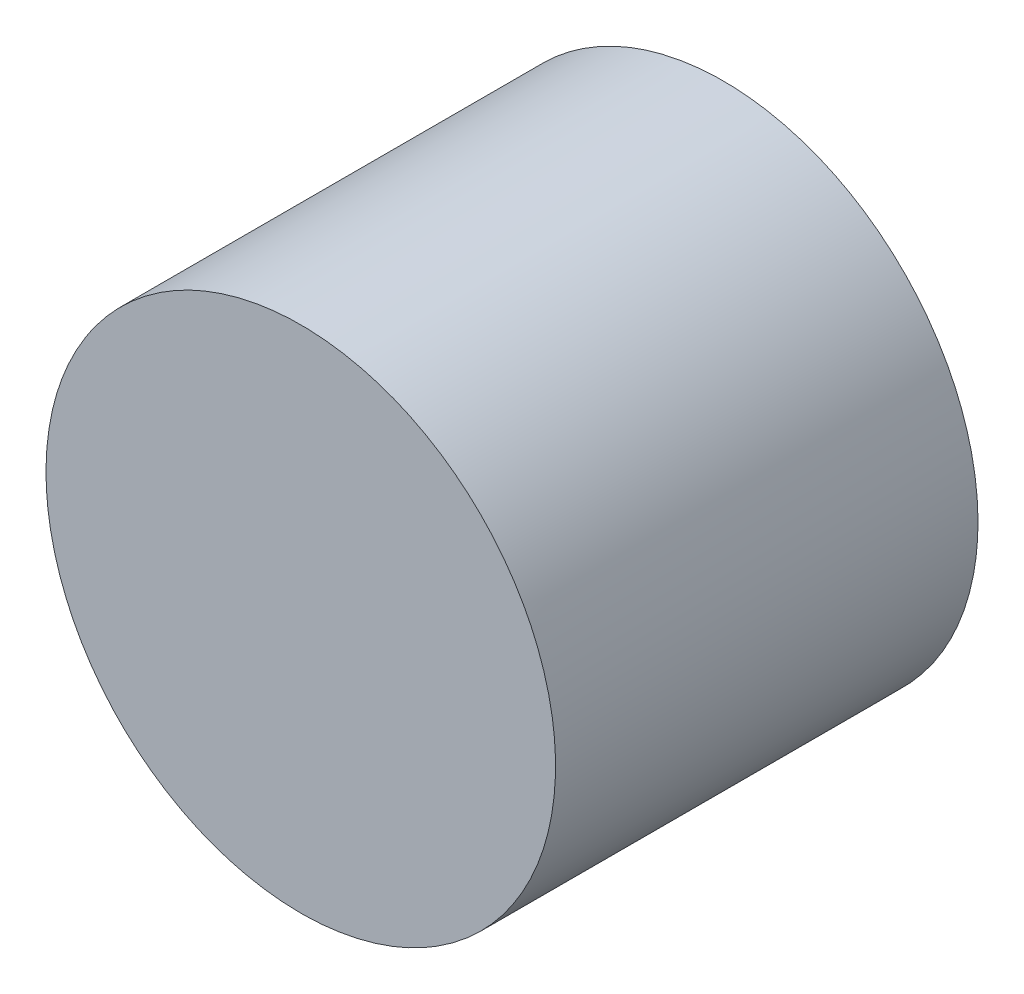
ISO-10303-21;
HEADER;
FILE_DESCRIPTION(('STEP AP214'),'2;1');
FILE_NAME('part.step','',(''),(''),'','','');
FILE_SCHEMA(('AUTOMOTIVE_DESIGN { 1 0 10303 214 1 1 1 1 }'));
ENDSEC;
DATA;
#1=APPLICATION_CONTEXT('core data for automotive mechanical design processes');
#2=APPLICATION_PROTOCOL_DEFINITION('international standard','automotive_design',2000,#1);
#3=PRODUCT_CONTEXT('',#1,'mechanical');
#4=PRODUCT('Part','Part','',(#3));
#5=PRODUCT_RELATED_PRODUCT_CATEGORY('part','',(#4));
#6=PRODUCT_DEFINITION_FORMATION('','',#4);
#7=PRODUCT_DEFINITION_CONTEXT('part definition',#1,'design');
#8=PRODUCT_DEFINITION('design','',#6,#7);
#9=PRODUCT_DEFINITION_SHAPE('','',#8);
#10=(LENGTH_UNIT() NAMED_UNIT(*) SI_UNIT(.MILLI.,.METRE.));
#11=(NAMED_UNIT(*) PLANE_ANGLE_UNIT() SI_UNIT($,.RADIAN.));
#12=(NAMED_UNIT(*) SI_UNIT($,.STERADIAN.) SOLID_ANGLE_UNIT());
#13=UNCERTAINTY_MEASURE_WITH_UNIT(LENGTH_MEASURE(1.E-05),#10,'distance_accuracy_value','');
#14=(GEOMETRIC_REPRESENTATION_CONTEXT(3) GLOBAL_UNCERTAINTY_ASSIGNED_CONTEXT((#13)) GLOBAL_UNIT_ASSIGNED_CONTEXT((#10,
#11,#12)) REPRESENTATION_CONTEXT('',''));
#15=CARTESIAN_POINT('',(0.,0.,0.));
#16=DIRECTION('',(0.,0.,1.));
#17=DIRECTION('',(1.,0.,0.));
#18=AXIS2_PLACEMENT_3D('',#15,#16,#17);
#19=CARTESIAN_POINT('',(1.08717444967118,89.1708663738326,123.808385168912));
#20=CARTESIAN_POINT('',(1.15446644135423,89.1708663738326,123.808385168912));
#21=CARTESIAN_POINT('',(1.28905042472035,89.1976367925753,123.808385168912));
#22=CARTESIAN_POINT('',(1.46019261257854,89.3119903465489,123.808385168912));
#23=CARTESIAN_POINT('',(1.57454616655218,89.4831325344072,123.808385168912));
#24=CARTESIAN_POINT('',(1.61470179466628,89.6850085094563,123.808385168912));
#25=CARTESIAN_POINT('',(1.57454616655218,89.8868844845055,123.808385168912));
#26=CARTESIAN_POINT('',(1.46019261257854,90.0580266723637,123.808385168912));
#27=CARTESIAN_POINT('',(1.28905042472035,90.1723802263373,123.808385168912));
#28=CARTESIAN_POINT('',(1.08717444967118,90.2125358544514,123.808385168912));
#29=CARTESIAN_POINT('',(0.885298474622008,90.1723802263373,123.808385168912));
#30=CARTESIAN_POINT('',(0.714156286763815,90.0580266723636,123.808385168912));
#31=CARTESIAN_POINT('',(0.599802732790181,89.8868844845055,123.808385168912));
#32=CARTESIAN_POINT('',(0.559647104676082,89.6850085094563,123.808385168912));
#33=CARTESIAN_POINT('',(0.599802732790181,89.4831325344071,123.808385168912));
#34=CARTESIAN_POINT('',(0.714156286763815,89.3119903465489,123.808385168912));
#35=CARTESIAN_POINT('',(0.885298474622008,89.1976367925753,123.808385168912));
#36=CARTESIAN_POINT('',(1.01988245798812,89.1708663738326,123.808385168912));
#37=CARTESIAN_POINT('',(1.08717444967118,89.1708663738326,123.808385168912));
#38=B_SPLINE_CURVE_WITH_KNOTS('',3,(#19,#20,#21,#22,#23,#24,#25,#26,#27,#28,#29,#30,#31,#32,#33,
#34,#35,#36,#37),.UNSPECIFIED.,.T.,.F.,(4,1,1,1,1,1,1,1,1,1,1,1,1,1,1,1,4),(0.,
0.0625000000000003,0.125000000000001,0.187499999999999,0.25,0.312500000000002,0.374999999999999,
0.4375,0.5,0.562500000000001,0.625000000000001,0.687499999999999,0.75,0.812500000000001,
0.874999999999999,0.9375,1.),.UNSPECIFIED.);
#39=DIRECTION('',(0.,0.,1.));
#40=VECTOR('',#39,1.);
#41=SURFACE_OF_LINEAR_EXTRUSION('',#38,#40);
#42=CARTESIAN_POINT('',(1.08717444967118,89.1708663738326,123.808385168912));
#43=CARTESIAN_POINT('',(1.15446644135423,89.1708663738326,123.808385168912));
#44=CARTESIAN_POINT('',(1.28905042472035,89.1976367925753,123.808385168912));
#45=CARTESIAN_POINT('',(1.46019261257854,89.3119903465489,123.808385168912));
#46=CARTESIAN_POINT('',(1.57454616655218,89.4831325344072,123.808385168912));
#47=CARTESIAN_POINT('',(1.61470179466628,89.6850085094563,123.808385168912));
#48=CARTESIAN_POINT('',(1.57454616655218,89.8868844845055,123.808385168912));
#49=CARTESIAN_POINT('',(1.46019261257854,90.0580266723637,123.808385168912));
#50=CARTESIAN_POINT('',(1.28905042472035,90.1723802263373,123.808385168912));
#51=CARTESIAN_POINT('',(1.08717444967118,90.2125358544514,123.808385168912));
#52=CARTESIAN_POINT('',(0.885298474622008,90.1723802263373,123.808385168912));
#53=CARTESIAN_POINT('',(0.714156286763815,90.0580266723636,123.808385168912));
#54=CARTESIAN_POINT('',(0.599802732790181,89.8868844845055,123.808385168912));
#55=CARTESIAN_POINT('',(0.559647104676082,89.6850085094563,123.808385168912));
#56=CARTESIAN_POINT('',(0.599802732790181,89.4831325344071,123.808385168912));
#57=CARTESIAN_POINT('',(0.714156286763815,89.3119903465489,123.808385168912));
#58=CARTESIAN_POINT('',(0.885298474622008,89.1976367925753,123.808385168912));
#59=CARTESIAN_POINT('',(1.01988245798812,89.1708663738326,123.808385168912));
#60=CARTESIAN_POINT('',(1.08717444967118,89.1708663738326,123.808385168912));
#61=B_SPLINE_CURVE_WITH_KNOTS('',3,(#42,#43,#44,#45,#46,#47,#48,#49,#50,#51,#52,#53,#54,#55,#56,
#57,#58,#59,#60),.UNSPECIFIED.,.T.,.F.,(4,1,1,1,1,1,1,1,1,1,1,1,1,1,1,1,4),(0.,
0.0625000000000003,0.125000000000001,0.187499999999999,0.25,0.312500000000002,0.374999999999999,
0.4375,0.5,0.562500000000001,0.625000000000001,0.687499999999999,0.75,0.812500000000001,
0.874999999999999,0.9375,1.),.UNSPECIFIED.);
#62=CARTESIAN_POINT('',(1.08717444967118,89.1708663738326,123.808385168912));
#63=VERTEX_POINT('',#62);
#64=EDGE_CURVE('E9',#63,#63,#61,.T.);
#65=ORIENTED_EDGE('',*,*,#64,.T.);
#66=EDGE_LOOP('',(#65));
#67=FACE_BOUND('',#66,.T.);
#68=CARTESIAN_POINT('',(1.08717444967118,89.1708663738326,124.660837467507));
#69=CARTESIAN_POINT('',(1.07876275223544,89.1708663677429,124.660837467507));
#70=CARTESIAN_POINT('',(1.07035122939483,89.1710755268702,124.660837467507));
#71=CARTESIAN_POINT('',(1.0535481908906,89.1719081286321,124.660837467507));
#72=CARTESIAN_POINT('',(1.04515667643318,89.1725315956393,124.660837467507));
#73=CARTESIAN_POINT('',(1.02841373267933,89.1741888221434,124.660837467507));
#74=CARTESIAN_POINT('',(1.02006230617347,89.1752226097958,124.660837467507));
#75=CARTESIAN_POINT('',(1.00341949531202,89.1776965007436,124.660837467507));
#76=CARTESIAN_POINT('',(0.995128113561799,89.1791366215629,124.660837467507));
#77=CARTESIAN_POINT('',(0.97862538519768,89.1824192180605,124.660837467507));
#78=CARTESIAN_POINT('',(0.970414038583785,89.1842616937387,124.660837467507));
#79=CARTESIAN_POINT('',(0.954091365970359,89.1883450462289,124.660837467507));
#80=CARTESIAN_POINT('',(0.945980035672058,89.1905859058539,124.660837467507));
#81=CARTESIAN_POINT('',(0.929877392462701,89.195462069037,124.660837467507));
#82=CARTESIAN_POINT('',(0.921886071353629,89.1980973455158,124.660837467507));
#83=CARTESIAN_POINT('',(0.906043416453419,89.2037583899285,124.660837467507));
#84=CARTESIAN_POINT('',(0.898192074454572,89.2067841348809,124.660837467507));
#85=CARTESIAN_POINT('',(0.88264947051977,89.2132220922228,124.660837467507));
#86=CARTESIAN_POINT('',(0.874958208583815,89.2166343046122,124.660837467507));
#87=CARTESIAN_POINT('',(0.859752796967187,89.2238337904464,124.660837467507));
#88=CARTESIAN_POINT('',(0.852238657733153,89.2276210859452,124.660837467507));
#89=CARTESIAN_POINT('',(0.83740440152103,89.2355594060446,124.660837467507));
#90=CARTESIAN_POINT('',(0.830084297894062,89.2397104555901,124.660837467507));
#91=CARTESIAN_POINT('',(0.815655058981271,89.2483649620552,124.660837467507));
#92=CARTESIAN_POINT('',(0.808545932808855,89.2528684341677,124.660837467507));
#93=CARTESIAN_POINT('',(0.794555596121782,89.2622164782792,124.660837467507));
#94=CARTESIAN_POINT('',(0.787674385607126,89.2670610502784,124.660837467507));
#95=CARTESIAN_POINT('',(0.774156833546462,89.2770799925402,124.660837467507));
#96=CARTESIAN_POINT('',(0.767520481451673,89.2822543485692,124.660837467507));
#97=CARTESIAN_POINT('',(0.754509605905568,89.2929215506804,124.660837467507));
#98=CARTESIAN_POINT('',(0.748135064517465,89.2984143748818,124.660837467507));
#99=CARTESIAN_POINT('',(0.735664747802227,89.3097072195089,124.660837467507));
#100=CARTESIAN_POINT('',(0.72956895609752,89.3155072218434,124.660837467507));
#101=CARTESIAN_POINT('',(0.717673162058296,89.3274030158826,124.660837467507));
#102=CARTESIAN_POINT('',(0.711873159723778,89.3334988075873,124.660837467507));
#103=CARTESIAN_POINT('',(0.700580315096693,89.3459691243026,124.660837467507));
#104=CARTESIAN_POINT('',(0.695087490895299,89.3523436656907,124.660837467507));
#105=CARTESIAN_POINT('',(0.684420288784116,89.3653545412368,124.660837467507));
#106=CARTESIAN_POINT('',(0.679245932755136,89.3719908933316,124.660837467507));
#107=CARTESIAN_POINT('',(0.669226990493276,89.3855084453922,124.660837467507));
#108=CARTESIAN_POINT('',(0.664382418494125,89.3923896559069,124.660837467507));
#109=CARTESIAN_POINT('',(0.655034374382544,89.406379992594,124.660837467507));
#110=CARTESIAN_POINT('',(0.650530902270114,89.4134891187663,124.660837467507));
#111=CARTESIAN_POINT('',(0.641876395805037,89.4279183576792,124.660837467507));
#112=CARTESIAN_POINT('',(0.637725346259578,89.4352384613064,124.660837467507));
#113=CARTESIAN_POINT('',(0.629787026160121,89.4500727175181,124.660837467507));
#114=CARTESIAN_POINT('',(0.625999730661272,89.4575868567516,124.660837467507));
#115=CARTESIAN_POINT('',(0.618800244827186,89.4727922683697,124.660837467507));
#116=CARTESIAN_POINT('',(0.615388032437854,89.4804835303076,124.660837467507));
#117=CARTESIAN_POINT('',(0.608950075095686,89.496026134237,124.660837467507));
#118=CARTESIAN_POINT('',(0.605924330142848,89.5038774762285,124.660837467507));
#119=CARTESIAN_POINT('',(0.600263285731319,89.5197201311487,124.660837467507));
#120=CARTESIAN_POINT('',(0.597628009254118,89.5277114522851,124.660837467507));
#121=CARTESIAN_POINT('',(0.592751846066494,89.5438140954198,124.660837467507));
#122=CARTESIAN_POINT('',(0.590510986435415,89.5519254256162,124.660837467507));
#123=CARTESIAN_POINT('',(0.586427633962025,89.5682480985082,124.660837467507));
#124=CARTESIAN_POINT('',(0.584585158306807,89.5764594455026,124.660837467507));
#125=CARTESIAN_POINT('',(0.581302561746445,89.5929621728272,124.660837467507));
#126=CARTESIAN_POINT('',(0.579862440841302,89.6012535531574,124.660837467507));
#127=CARTESIAN_POINT('',(0.577388550127835,89.6178963678982,124.660837467507));
#128=CARTESIAN_POINT('',(0.576354762795633,89.6262477997032,124.660837467507));
#129=CARTESIAN_POINT('',(0.574697535416913,89.6429907289801,124.660837467507));
#130=CARTESIAN_POINT('',(0.574074067215104,89.6513822236632,124.660837467507));
#131=CARTESIAN_POINT('',(0.573241468716913,89.6681853161908,124.660837467507));
#132=CARTESIAN_POINT('',(0.573032314047449,89.6765969128236,124.660837467507));
#133=CARTESIAN_POINT('',(0.573032314047449,89.693420106089,124.660837467507));
#134=CARTESIAN_POINT('',(0.573241468716913,89.7018317027218,124.660837467507));
#135=CARTESIAN_POINT('',(0.574074067215104,89.7186347952493,124.660837467507));
#136=CARTESIAN_POINT('',(0.574697535416913,89.7270262899325,124.660837467507));
#137=CARTESIAN_POINT('',(0.576354762795633,89.7437692192094,124.660837467507));
#138=CARTESIAN_POINT('',(0.577388550127835,89.7521206510144,124.660837467507));
#139=CARTESIAN_POINT('',(0.579862440841302,89.7687634657552,124.660837467507));
#140=CARTESIAN_POINT('',(0.581302561746446,89.7770548460854,124.660837467507));
#141=CARTESIAN_POINT('',(0.584585158306807,89.79355757341,124.660837467507));
#142=CARTESIAN_POINT('',(0.586427633962025,89.8017689204044,124.660837467507));
#143=CARTESIAN_POINT('',(0.590510986435415,89.8180915932964,124.660837467507));
#144=CARTESIAN_POINT('',(0.592751846066495,89.8262029234927,124.660837467507));
#145=CARTESIAN_POINT('',(0.597628009254118,89.8423055666275,124.660837467507));
#146=CARTESIAN_POINT('',(0.600263285731319,89.8502968877638,124.660837467507));
#147=CARTESIAN_POINT('',(0.605924330142849,89.8661395426841,124.660837467507));
#148=CARTESIAN_POINT('',(0.608950075095687,89.8739908846756,124.660837467507));
#149=CARTESIAN_POINT('',(0.615388032437856,89.889533488605,124.660837467507));
#150=CARTESIAN_POINT('',(0.618800244827186,89.8972247505429,124.660837467507));
#151=CARTESIAN_POINT('',(0.62599973066127,89.912430162161,124.660837467507));
#152=CARTESIAN_POINT('',(0.629787026160119,89.9199443013945,124.660837467507));
#153=CARTESIAN_POINT('',(0.637725346259578,89.9347785576062,124.660837467507));
#154=CARTESIAN_POINT('',(0.641876395805041,89.9420986612333,124.660837467507));
#155=CARTESIAN_POINT('',(0.650530902270117,89.9565279001462,124.660837467507));
#156=CARTESIAN_POINT('',(0.655034374382542,89.9636370263186,124.660837467507));
#157=CARTESIAN_POINT('',(0.664382418494124,89.9776273630057,124.660837467507));
#158=CARTESIAN_POINT('',(0.669226990493281,89.9845085735203,124.660837467507));
#159=CARTESIAN_POINT('',(0.679245932755139,89.998026125581,124.660837467507));
#160=CARTESIAN_POINT('',(0.684420288784113,90.0046624776758,124.660837467507));
#161=CARTESIAN_POINT('',(0.695087490895295,90.0176733532219,124.660837467507));
#162=CARTESIAN_POINT('',(0.700580315096694,90.02404789461,124.660837467507));
#163=CARTESIAN_POINT('',(0.711873159723782,90.0365182113252,124.660837467507));
#164=CARTESIAN_POINT('',(0.717673162058298,90.0426140030299,124.660837467507));
#165=CARTESIAN_POINT('',(0.72956895609752,90.0545097970692,124.660837467507));
#166=CARTESIAN_POINT('',(0.735664747802225,90.0603097994037,124.660837467507));
#167=CARTESIAN_POINT('',(0.748135064517465,90.0716026440308,124.660837467507));
#168=CARTESIAN_POINT('',(0.754509605905571,90.0770954682322,124.660837467507));
#169=CARTESIAN_POINT('',(0.767520481451674,90.0877626703433,124.660837467507));
#170=CARTESIAN_POINT('',(0.774156833546459,90.0929370263723,124.660837467507));
#171=CARTESIAN_POINT('',(0.78767438560713,90.1029559686342,124.660837467507));
#172=CARTESIAN_POINT('',(0.794555596121797,90.1078005406333,124.660837467507));
#173=CARTESIAN_POINT('',(0.808545932808842,90.1171485847449,124.660837467507));
#174=CARTESIAN_POINT('',(0.815655058981221,90.1216520568573,124.660837467507));
#175=CARTESIAN_POINT('',(0.830084297894114,90.1303065633224,124.660837467507));
#176=CARTESIAN_POINT('',(0.837404401521223,90.1344576128679,124.660837467507));
#177=CARTESIAN_POINT('',(0.852238657732961,90.1423959329674,124.660837467507));
#178=CARTESIAN_POINT('',(0.85975279696647,90.1461832284662,124.660837467507));
#179=CARTESIAN_POINT('',(0.874958208584534,90.1533827143003,124.660837467507));
#180=CARTESIAN_POINT('',(0.882649470522451,90.1567949266896,124.660837467507));
#181=CARTESIAN_POINT('',(0.898192074451896,90.1632328840318,124.660837467507));
#182=CARTESIAN_POINT('',(0.906043416443423,90.1662586289846,124.660837467507));
#183=CARTESIAN_POINT('',(0.921886071363625,90.1719196733962,124.660837467507));
#184=CARTESIAN_POINT('',(0.929877392500011,90.1745549498734,124.660837467507));
#185=CARTESIAN_POINT('',(0.945980035634747,90.179431113061,124.660837467507));
#186=CARTESIAN_POINT('',(0.954091365831104,90.181671972692,124.660837467507));
#187=CARTESIAN_POINT('',(0.97041403872305,90.1857553251654,124.660837467507));
#188=CARTESIAN_POINT('',(0.978625385717429,90.1875978008207,124.660837467507));
#189=CARTESIAN_POINT('',(0.995128113042051,90.190880397381,124.660837467507));
#190=CARTESIAN_POINT('',(1.0034194933723,90.1923205182862,124.660837467507));
#191=CARTESIAN_POINT('',(1.02006230811312,90.1947944089996,124.660837467507));
#192=CARTESIAN_POINT('',(1.02841373991804,90.1958281963318,124.660837467507));
#193=CARTESIAN_POINT('',(1.04515666919497,90.1974854237105,124.660837467507));
#194=CARTESIAN_POINT('',(1.05354816387812,90.1981088919124,124.660837467507));
#195=CARTESIAN_POINT('',(1.07035125640571,90.1989414904105,124.660837467507));
#196=CARTESIAN_POINT('',(1.07876285303845,90.19915064508,124.660837467507));
#197=CARTESIAN_POINT('',(1.09558604630391,90.19915064508,124.660837467507));
#198=CARTESIAN_POINT('',(1.10399764293665,90.1989414904105,124.660837467507));
#199=CARTESIAN_POINT('',(1.12080073546423,90.1981088919124,124.660837467507));
#200=CARTESIAN_POINT('',(1.12919223014739,90.1974854237105,124.660837467507));
#201=CARTESIAN_POINT('',(1.14593515942432,90.1958281963318,124.660837467507));
#202=CARTESIAN_POINT('',(1.15428659122924,90.1947944089996,124.660837467507));
#203=CARTESIAN_POINT('',(1.17092940597006,90.1923205182862,124.660837467507));
#204=CARTESIAN_POINT('',(1.17922078630031,90.190880397381,124.660837467507));
#205=CARTESIAN_POINT('',(1.19572351362493,90.1875978008206,124.660837467507));
#206=CARTESIAN_POINT('',(1.20393486061931,90.1857553251654,124.660837467507));
#207=CARTESIAN_POINT('',(1.22025753351126,90.181671972692,124.660837467507));
#208=CARTESIAN_POINT('',(1.22836886370761,90.179431113061,124.660837467507));
#209=CARTESIAN_POINT('',(1.24447150684235,90.1745549498733,124.660837467507));
#210=CARTESIAN_POINT('',(1.25246282797873,90.1719196733961,124.660837467507));
#211=CARTESIAN_POINT('',(1.26830548289894,90.1662586289846,124.660837467507));
#212=CARTESIAN_POINT('',(1.27615682489046,90.1632328840318,124.660837467507));
#213=CARTESIAN_POINT('',(1.29169942881991,90.1567949266896,124.660837467507));
#214=CARTESIAN_POINT('',(1.29939069075783,90.1533827143003,124.660837467507));
#215=CARTESIAN_POINT('',(1.31459610237589,90.1461832284662,124.660837467507));
#216=CARTESIAN_POINT('',(1.32211024160939,90.1423959329673,124.660837467507));
#217=CARTESIAN_POINT('',(1.33694449782113,90.1344576128679,124.660837467507));
#218=CARTESIAN_POINT('',(1.34426460144825,90.1303065633224,124.660837467507));
#219=CARTESIAN_POINT('',(1.35869384036114,90.1216520568573,124.660837467507));
#220=CARTESIAN_POINT('',(1.36580296653352,90.1171485847449,124.660837467507));
#221=CARTESIAN_POINT('',(1.37979330322056,90.1078005406333,124.660837467507));
#222=CARTESIAN_POINT('',(1.38667451373523,90.1029559686342,124.660837467507));
#223=CARTESIAN_POINT('',(1.4001920657959,90.0929370263723,124.660837467507));
#224=CARTESIAN_POINT('',(1.40682841789069,90.0877626703434,124.660837467507));
#225=CARTESIAN_POINT('',(1.41983929343679,90.0770954682322,124.660837467507));
#226=CARTESIAN_POINT('',(1.42621383482489,90.0716026440308,124.660837467507));
#227=CARTESIAN_POINT('',(1.43868415154013,90.0603097994037,124.660837467507));
#228=CARTESIAN_POINT('',(1.44477994324484,90.0545097970692,124.660837467507));
#229=CARTESIAN_POINT('',(1.45667573728406,90.04261400303,124.660837467507));
#230=CARTESIAN_POINT('',(1.46247573961858,90.0365182113252,124.660837467507));
#231=CARTESIAN_POINT('',(1.47376858424567,90.02404789461,124.660837467507));
#232=CARTESIAN_POINT('',(1.47926140844706,90.0176733532219,124.660837467507));
#233=CARTESIAN_POINT('',(1.48992861055824,90.0046624776758,124.660837467507));
#234=CARTESIAN_POINT('',(1.49510296658722,89.998026125581,124.660837467507));
#235=CARTESIAN_POINT('',(1.50512190884908,89.9845085735203,124.660837467507));
#236=CARTESIAN_POINT('',(1.50996648084824,89.9776273630057,124.660837467507));
#237=CARTESIAN_POINT('',(1.51931452495982,89.9636370263186,124.660837467507));
#238=CARTESIAN_POINT('',(1.52381799707224,89.9565279001463,124.660837467507));
#239=CARTESIAN_POINT('',(1.53247250353732,89.9420986612334,124.660837467507));
#240=CARTESIAN_POINT('',(1.53662355308278,89.9347785576063,124.660837467507));
#241=CARTESIAN_POINT('',(1.54456187318224,89.9199443013945,124.660837467507));
#242=CARTESIAN_POINT('',(1.54834916868109,89.912430162161,124.660837467507));
#243=CARTESIAN_POINT('',(1.55554865451517,89.8972247505429,124.660837467507));
#244=CARTESIAN_POINT('',(1.5589608669045,89.889533488605,124.660837467507));
#245=CARTESIAN_POINT('',(1.56539882424667,89.8739908846756,124.660837467507));
#246=CARTESIAN_POINT('',(1.56842456919951,89.8661395426841,124.660837467507));
#247=CARTESIAN_POINT('',(1.57408561361104,89.8502968877639,124.660837467507));
#248=CARTESIAN_POINT('',(1.57672089008824,89.8423055666275,124.660837467507));
#249=CARTESIAN_POINT('',(1.58159705327586,89.8262029234927,124.660837467507));
#250=CARTESIAN_POINT('',(1.58383791290694,89.8180915932964,124.660837467507));
#251=CARTESIAN_POINT('',(1.58792126538033,89.8017689204044,124.660837467507));
#252=CARTESIAN_POINT('',(1.58976374103555,89.79355757341,124.660837467507));
#253=CARTESIAN_POINT('',(1.59304633759591,89.7770548460854,124.660837467507));
#254=CARTESIAN_POINT('',(1.59448645850106,89.7687634657552,124.660837467507));
#255=CARTESIAN_POINT('',(1.59696034921452,89.7521206510143,124.660837467507));
#256=CARTESIAN_POINT('',(1.59799413654673,89.7437692192094,124.660837467507));
#257=CARTESIAN_POINT('',(1.59965136392545,89.7270262899325,124.660837467507));
#258=CARTESIAN_POINT('',(1.60027483212726,89.7186347952493,124.660837467507));
#259=CARTESIAN_POINT('',(1.60110743062545,89.7018317027217,124.660837467507));
#260=CARTESIAN_POINT('',(1.60131658529491,89.693420106089,124.660837467507));
#261=CARTESIAN_POINT('',(1.60131658529491,89.6765969128236,124.660837467507));
#262=CARTESIAN_POINT('',(1.60110743062545,89.6681853161908,124.660837467507));
#263=CARTESIAN_POINT('',(1.60027483212726,89.6513822236632,124.660837467507));
#264=CARTESIAN_POINT('',(1.59965136392545,89.6429907289801,124.660837467507));
#265=CARTESIAN_POINT('',(1.59799413654673,89.6262477997032,124.660837467507));
#266=CARTESIAN_POINT('',(1.59696034921452,89.6178963678982,124.660837467507));
#267=CARTESIAN_POINT('',(1.59448645850106,89.6012535531574,124.660837467507));
#268=CARTESIAN_POINT('',(1.59304633759591,89.5929621728272,124.660837467507));
#269=CARTESIAN_POINT('',(1.58976374103555,89.5764594455026,124.660837467507));
#270=CARTESIAN_POINT('',(1.58792126538033,89.5682480985082,124.660837467507));
#271=CARTESIAN_POINT('',(1.58383791290694,89.5519254256162,124.660837467507));
#272=CARTESIAN_POINT('',(1.58159705327586,89.5438140954199,124.660837467507));
#273=CARTESIAN_POINT('',(1.57672089008824,89.5277114522851,124.660837467507));
#274=CARTESIAN_POINT('',(1.57408561361104,89.5197201311488,124.660837467507));
#275=CARTESIAN_POINT('',(1.56842456919951,89.5038774762286,124.660837467507));
#276=CARTESIAN_POINT('',(1.56539882424667,89.496026134237,124.660837467507));
#277=CARTESIAN_POINT('',(1.5589608669045,89.4804835303076,124.660837467507));
#278=CARTESIAN_POINT('',(1.55554865451517,89.4727922683697,124.660837467507));
#279=CARTESIAN_POINT('',(1.54834916868109,89.4575868567516,124.660837467507));
#280=CARTESIAN_POINT('',(1.54456187318224,89.4500727175181,124.660837467507));
#281=CARTESIAN_POINT('',(1.53662355308278,89.4352384613064,124.660837467507));
#282=CARTESIAN_POINT('',(1.53247250353732,89.4279183576793,124.660837467507));
#283=CARTESIAN_POINT('',(1.52381799707224,89.4134891187663,124.660837467507));
#284=CARTESIAN_POINT('',(1.51931452495982,89.406379992594,124.660837467507));
#285=CARTESIAN_POINT('',(1.50996648084823,89.3923896559069,124.660837467507));
#286=CARTESIAN_POINT('',(1.50512190884908,89.3855084453923,124.660837467507));
#287=CARTESIAN_POINT('',(1.49510296658722,89.3719908933316,124.660837467507));
#288=CARTESIAN_POINT('',(1.48992861055824,89.3653545412368,124.660837467507));
#289=CARTESIAN_POINT('',(1.47926140844706,89.3523436656907,124.660837467507));
#290=CARTESIAN_POINT('',(1.47376858424567,89.3459691243026,124.660837467507));
#291=CARTESIAN_POINT('',(1.46247573961858,89.3334988075873,124.660837467507));
#292=CARTESIAN_POINT('',(1.45667573728406,89.3274030158826,124.660837467507));
#293=CARTESIAN_POINT('',(1.44477994324484,89.3155072218434,124.660837467507));
#294=CARTESIAN_POINT('',(1.43868415154013,89.3097072195089,124.660837467507));
#295=CARTESIAN_POINT('',(1.4262138348249,89.2984143748818,124.660837467507));
#296=CARTESIAN_POINT('',(1.41983929343679,89.2929215506804,124.660837467507));
#297=CARTESIAN_POINT('',(1.40682841789068,89.2822543485692,124.660837467507));
#298=CARTESIAN_POINT('',(1.40019206579589,89.2770799925403,124.660837467507));
#299=CARTESIAN_POINT('',(1.38667451373523,89.2670610502784,124.660837467507));
#300=CARTESIAN_POINT('',(1.37979330322058,89.2622164782792,124.660837467507));
#301=CARTESIAN_POINT('',(1.3658029665335,89.2528684341677,124.660837467507));
#302=CARTESIAN_POINT('',(1.35869384036109,89.2483649620552,124.660837467507));
#303=CARTESIAN_POINT('',(1.3442646014483,89.2397104555901,124.660837467507));
#304=CARTESIAN_POINT('',(1.33694449782133,89.2355594060447,124.660837467507));
#305=CARTESIAN_POINT('',(1.3221102416092,89.2276210859453,124.660837467507));
#306=CARTESIAN_POINT('',(1.31459610237517,89.2238337904464,124.660837467507));
#307=CARTESIAN_POINT('',(1.29939069075854,89.2166343046123,124.660837467507));
#308=CARTESIAN_POINT('',(1.29169942882258,89.2132220922228,124.660837467507));
#309=CARTESIAN_POINT('',(1.27615682488778,89.206784134881,124.660837467507));
#310=CARTESIAN_POINT('',(1.26830548288894,89.2037583899286,124.660837467507));
#311=CARTESIAN_POINT('',(1.25246282798873,89.1980973455158,124.660837467507));
#312=CARTESIAN_POINT('',(1.24447150687966,89.195462069037,124.660837467507));
#313=CARTESIAN_POINT('',(1.2283688636703,89.1905859058539,124.660837467507));
#314=CARTESIAN_POINT('',(1.220257533372,89.1883450462289,124.660837467507));
#315=CARTESIAN_POINT('',(1.20393486075857,89.1842616937387,124.660837467507));
#316=CARTESIAN_POINT('',(1.19572351414468,89.1824192180605,124.660837467507));
#317=CARTESIAN_POINT('',(1.17922078578056,89.179136621563,124.660837467507));
#318=CARTESIAN_POINT('',(1.17092940403033,89.1776965007436,124.660837467507));
#319=CARTESIAN_POINT('',(1.15428659316889,89.1752226097958,124.660837467507));
#320=CARTESIAN_POINT('',(1.14593516666303,89.1741888221434,124.660837467507));
#321=CARTESIAN_POINT('',(1.12919222290918,89.1725315956393,124.660837467507));
#322=CARTESIAN_POINT('',(1.12080070845176,89.1719081286321,124.660837467507));
#323=CARTESIAN_POINT('',(1.10399766994753,89.1710755268702,124.660837467507));
#324=CARTESIAN_POINT('',(1.09558614710692,89.1708663677429,124.660837467507));
#325=CARTESIAN_POINT('',(1.08717444967118,89.1708663738326,124.660837467507));
#326=B_SPLINE_CURVE_WITH_KNOTS('',3,(#68,#69,#70,#71,#72,#73,#74,#75,#76,#77,#78,#79,#80,#81,
#82,#83,#84,#85,#86,#87,#88,#89,#90,#91,#92,#93,#94,#95,#96,#97,#98,#99,#100,#101,#102,#103,
#104,#105,#106,#107,#108,#109,#110,#111,#112,#113,#114,#115,#116,#117,#118,#119,#120,#121,#122,
#123,#124,#125,#126,#127,#128,#129,#130,#131,#132,#133,#134,#135,#136,#137,#138,#139,#140,#141,
#142,#143,#144,#145,#146,#147,#148,#149,#150,#151,#152,#153,#154,#155,#156,#157,#158,#159,#160,
#161,#162,#163,#164,#165,#166,#167,#168,#169,#170,#171,#172,#173,#174,#175,#176,#177,#178,#179,
#180,#181,#182,#183,#184,#185,#186,#187,#188,#189,#190,#191,#192,#193,#194,#195,#196,#197,#198,
#199,#200,#201,#202,#203,#204,#205,#206,#207,#208,#209,#210,#211,#212,#213,#214,#215,#216,#217,
#218,#219,#220,#221,#222,#223,#224,#225,#226,#227,#228,#229,#230,#231,#232,#233,#234,#235,#236,
#237,#238,#239,#240,#241,#242,#243,#244,#245,#246,#247,#248,#249,#250,#251,#252,#253,#254,#255,
#256,#257,#258,#259,#260,#261,#262,#263,#264,#265,#266,#267,#268,#269,#270,#271,#272,#273,#274,
#275,#276,#277,#278,#279,#280,#281,#282,#283,#284,#285,#286,#287,#288,#289,#290,#291,#292,#293,
#294,#295,#296,#297,#298,#299,#300,#301,#302,#303,#304,#305,#306,#307,#308,#309,#310,#311,#312,
#313,#314,#315,#316,#317,#318,#319,#320,#321,#322,#323,#324,#325),.UNSPECIFIED.,.F.,.F.,(4,2,2,
2,2,2,2,2,2,2,2,2,2,2,2,2,2,2,2,2,2,2,2,2,2,2,2,2,2,2,2,2,2,2,2,2,2,2,2,2,2,2,2,2,2,2,2,2,2,2,2,
2,2,2,2,2,2,2,2,2,2,2,2,2,2,2,2,2,2,2,2,2,2,2,2,2,2,2,2,2,2,2,2,2,2,2,2,2,2,2,2,2,2,2,2,2,2,2,2,
2,2,2,2,2,2,2,2,2,2,2,2,2,2,2,2,2,2,2,2,2,2,2,2,2,2,2,2,2,4),(0.,0.0252322451196311,
0.0504659747238365,0.0757014361163383,0.100937986000661,0.126174535884981,0.151409997277487,
0.176643726881688,0.201875972001317,0.227108217120947,0.252341946725147,0.27757740811766,
0.302813958001983,0.328050507886307,0.353285969278812,0.378519698883021,0.403751944002658,
0.428984189122293,0.45421791872651,0.479453380118992,0.504689930003328,0.529926479887642,
0.555161941280166,0.580395670884359,0.605627916003987,0.630860161123612,0.656093890727805,
0.681329352120318,0.706565902004644,0.731802451888961,0.757037913281463,0.782271642885654,
0.807503888005302,0.832736133124936,0.857969862729127,0.883205324121643,0.90844187400596,
0.933678423890285,0.958913885282799,0.984147614886992,1.00937986000662,1.03461210512626,
1.05984583473045,1.08508129612295,1.11031784600728,1.1355543958916,1.1607898572841,
1.1860235868883,1.21125583200794,1.23648807712757,1.26172180673177,1.28695726812428,
1.3121938180086,1.33743036789292,1.36266582928544,1.38789955888964,1.41313180400927,
1.4383640491289,1.4635977787331,1.48883324012561,1.51406979000993,1.53930633989425,
1.56454180128675,1.58977553089096,1.61500777601059,1.64024002113022,1.66547375073443,
1.69070921212693,1.71594576201125,1.74118231189558,1.76641777328808,1.79165150289228,
1.81688374801191,1.84211599313154,1.86734972273575,1.89258518412825,1.91782173401258,
1.9430582838969,1.96829374528939,1.9935274748936,2.01875972001323,2.04399196513285,
2.06922569473706,2.09446115612956,2.11969770601389,2.14493425589821,2.1701697172907,
2.19540344689492,2.22063569201454,2.24586793713417,2.27110166673838,2.29633712813089,
2.32157367801522,2.34681022789955,2.37204568929204,2.39727941889626,2.42251166401588,
2.44774390913552,2.4729776387397,2.4982131001322,2.52344965001653,2.54868619990085,
2.57392166129335,2.59915539089755,2.62438763601718,2.64961988113681,2.67485361074102,
2.70008907213351,2.72532562201784,2.75056217190216,2.77579763329468,2.80103136289888,
2.82626360801852,2.85149585313816,2.87672958274236,2.90196504413485,2.92720159401918,
2.95243814390351,2.97767360529601,3.00290733490021,3.02813958001984,3.05337182513947,
3.07860555474368,3.10384101613618,3.1290775660205,3.15431411590482,3.17954957729733,
3.20478330690154,3.23001555202117),.UNSPECIFIED.);
#327=CARTESIAN_POINT('',(1.08717444967118,89.1708663738326,124.660837467507));
#328=VERTEX_POINT('',#327);
#329=EDGE_CURVE('E24',#328,#328,#326,.F.);
#330=ORIENTED_EDGE('',*,*,#329,.F.);
#331=EDGE_LOOP('',(#330));
#332=FACE_BOUND('',#331,.T.);
#333=ADVANCED_FACE('F14',(#67,#332),#41,.T.);
#334=CARTESIAN_POINT('',(16.761447844137,68.1112219927909,123.808385168912));
#335=DIRECTION('',(0.,0.,1.));
#336=DIRECTION('',(0.,-1.,0.));
#337=AXIS2_PLACEMENT_3D('',#334,#335,#336);
#338=PLANE('',#337);
#339=ORIENTED_EDGE('',*,*,#64,.F.);
#340=EDGE_LOOP('',(#339));
#341=FACE_BOUND('',#340,.T.);
#342=ADVANCED_FACE('F62',(#341),#338,.F.);
#343=CARTESIAN_POINT('',(16.761447844137,68.1112219927909,124.660837467507));
#344=DIRECTION('',(0.,0.,1.));
#345=DIRECTION('',(0.,-1.,0.));
#346=AXIS2_PLACEMENT_3D('',#343,#344,#345);
#347=PLANE('',#346);
#348=ORIENTED_EDGE('',*,*,#329,.T.);
#349=EDGE_LOOP('',(#348));
#350=FACE_BOUND('',#349,.T.);
#351=ADVANCED_FACE('F31',(#350),#347,.T.);
#352=CLOSED_SHELL('',(#333,#342,#351));
#353=MANIFOLD_SOLID_BREP('B1',#352);
#354=ADVANCED_BREP_SHAPE_REPRESENTATION('',(#18,#353),#14);
#355=SHAPE_DEFINITION_REPRESENTATION(#9,#354);
ENDSEC;
END-ISO-10303-21;
